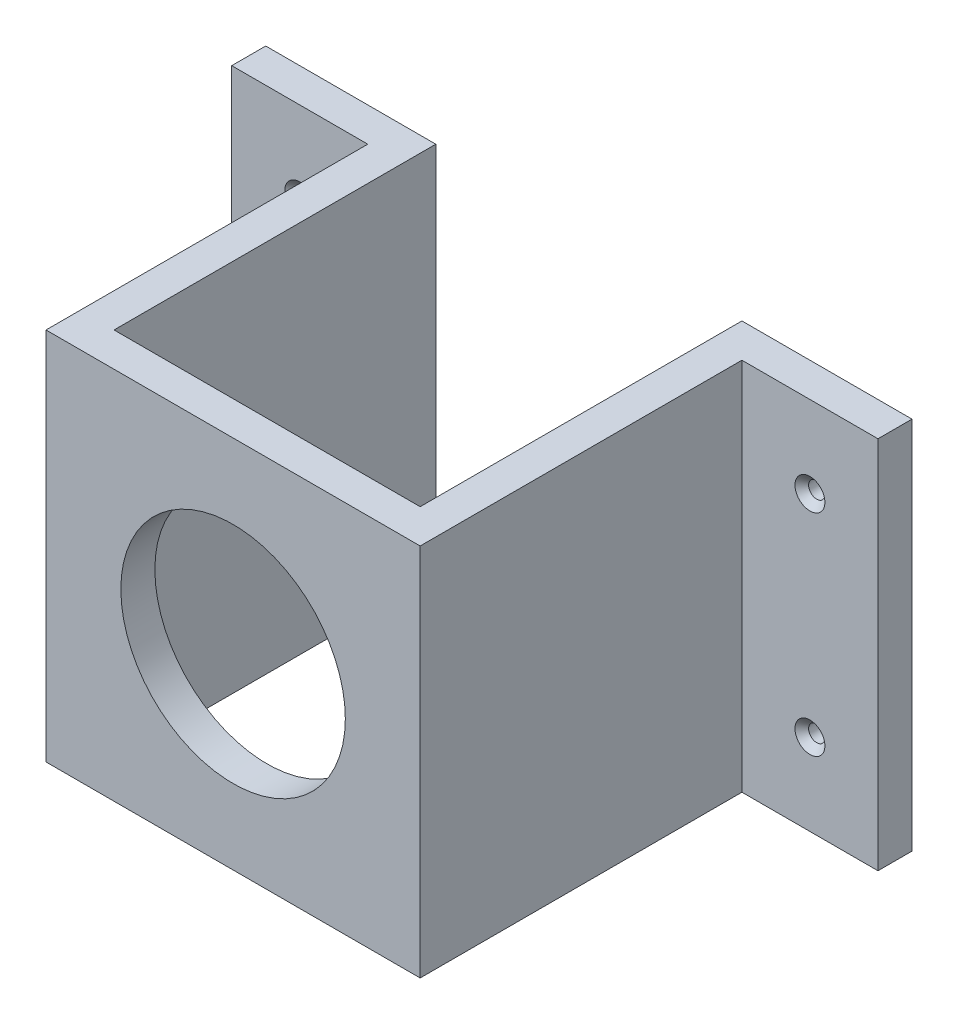
ISO-10303-21;
HEADER;
FILE_DESCRIPTION(('STEP AP214'),'2;1');
FILE_NAME('part.step','',(''),(''),'','','');
FILE_SCHEMA(('AUTOMOTIVE_DESIGN { 1 0 10303 214 1 1 1 1 }'));
ENDSEC;
DATA;
#1=APPLICATION_CONTEXT('core data for automotive mechanical design processes');
#2=APPLICATION_PROTOCOL_DEFINITION('international standard','automotive_design',2000,#1);
#3=PRODUCT_CONTEXT('',#1,'mechanical');
#4=PRODUCT('Part','Part','',(#3));
#5=PRODUCT_RELATED_PRODUCT_CATEGORY('part','',(#4));
#6=PRODUCT_DEFINITION_FORMATION('','',#4);
#7=PRODUCT_DEFINITION_CONTEXT('part definition',#1,'design');
#8=PRODUCT_DEFINITION('design','',#6,#7);
#9=PRODUCT_DEFINITION_SHAPE('','',#8);
#10=(LENGTH_UNIT() NAMED_UNIT(*) SI_UNIT(.MILLI.,.METRE.));
#11=(NAMED_UNIT(*) PLANE_ANGLE_UNIT() SI_UNIT($,.RADIAN.));
#12=(NAMED_UNIT(*) SI_UNIT($,.STERADIAN.) SOLID_ANGLE_UNIT());
#13=UNCERTAINTY_MEASURE_WITH_UNIT(LENGTH_MEASURE(1.E-05),#10,'distance_accuracy_value','');
#14=(GEOMETRIC_REPRESENTATION_CONTEXT(3) GLOBAL_UNCERTAINTY_ASSIGNED_CONTEXT((#13)) GLOBAL_UNIT_ASSIGNED_CONTEXT((#10,
#11,#12)) REPRESENTATION_CONTEXT('',''));
#15=CARTESIAN_POINT('',(0.,0.,0.));
#16=DIRECTION('',(0.,0.,1.));
#17=DIRECTION('',(1.,0.,0.));
#18=AXIS2_PLACEMENT_3D('',#15,#16,#17);
#19=CARTESIAN_POINT('',(-27.5,27.5,5.));
#20=DIRECTION('',(1.,0.,0.));
#21=DIRECTION('',(0.,1.,0.));
#22=AXIS2_PLACEMENT_3D('',#19,#20,#21);
#23=PLANE('',#22);
#24=DIRECTION('',(0.,1.,0.));
#25=VECTOR('',#24,1.);
#26=CARTESIAN_POINT('',(-27.5,27.5,-42.3));
#27=LINE('',#26,#25);
#28=CARTESIAN_POINT('',(-27.5,-27.5,-42.3));
#29=VERTEX_POINT('',#28);
#30=CARTESIAN_POINT('',(-27.5,27.5,-42.3));
#31=VERTEX_POINT('',#30);
#32=EDGE_CURVE('E50',#29,#31,#27,.T.);
#33=ORIENTED_EDGE('',*,*,#32,.F.);
#34=DIRECTION('',(0.,0.,-1.));
#35=VECTOR('',#34,1.);
#36=CARTESIAN_POINT('',(-27.5,-27.5,5.));
#37=LINE('',#36,#35);
#38=CARTESIAN_POINT('',(-27.5,-27.5,5.));
#39=VERTEX_POINT('',#38);
#40=EDGE_CURVE('E165',#39,#29,#37,.T.);
#41=ORIENTED_EDGE('',*,*,#40,.F.);
#42=DIRECTION('',(0.,-1.,0.));
#43=VECTOR('',#42,1.);
#44=CARTESIAN_POINT('',(-27.5,27.5,5.));
#45=LINE('',#44,#43);
#46=CARTESIAN_POINT('',(-27.5,27.5,5.));
#47=VERTEX_POINT('',#46);
#48=EDGE_CURVE('E323',#47,#39,#45,.T.);
#49=ORIENTED_EDGE('',*,*,#48,.F.);
#50=DIRECTION('',(0.,0.,-1.));
#51=VECTOR('',#50,1.);
#52=CARTESIAN_POINT('',(-27.5,27.5,5.));
#53=LINE('',#52,#51);
#54=EDGE_CURVE('E42',#47,#31,#53,.T.);
#55=ORIENTED_EDGE('',*,*,#54,.T.);
#56=EDGE_LOOP('',(#33,#41,#49,#55));
#57=FACE_BOUND('',#56,.T.);
#58=ADVANCED_FACE('F33',(#57),#23,.F.);
#59=CARTESIAN_POINT('',(27.5,27.5,5.));
#60=DIRECTION('',(-1.,0.,0.));
#61=DIRECTION('',(0.,-1.,0.));
#62=AXIS2_PLACEMENT_3D('',#59,#60,#61);
#63=PLANE('',#62);
#64=DIRECTION('',(0.,-1.,0.));
#65=VECTOR('',#64,1.);
#66=CARTESIAN_POINT('',(27.5,27.5,-42.3));
#67=LINE('',#66,#65);
#68=CARTESIAN_POINT('',(27.5,27.5,-42.3));
#69=VERTEX_POINT('',#68);
#70=CARTESIAN_POINT('',(27.5,-27.5,-42.3));
#71=VERTEX_POINT('',#70);
#72=EDGE_CURVE('E58',#69,#71,#67,.T.);
#73=ORIENTED_EDGE('',*,*,#72,.F.);
#74=DIRECTION('',(0.,0.,-1.));
#75=VECTOR('',#74,1.);
#76=CARTESIAN_POINT('',(27.5,27.5,5.));
#77=LINE('',#76,#75);
#78=CARTESIAN_POINT('',(27.5,27.5,5.));
#79=VERTEX_POINT('',#78);
#80=EDGE_CURVE('E11',#79,#69,#77,.T.);
#81=ORIENTED_EDGE('',*,*,#80,.F.);
#82=DIRECTION('',(0.,1.,0.));
#83=VECTOR('',#82,1.);
#84=CARTESIAN_POINT('',(27.5,27.5,5.));
#85=LINE('',#84,#83);
#86=CARTESIAN_POINT('',(27.5,-27.5,5.));
#87=VERTEX_POINT('',#86);
#88=EDGE_CURVE('E303',#87,#79,#85,.T.);
#89=ORIENTED_EDGE('',*,*,#88,.F.);
#90=DIRECTION('',(0.,0.,-1.));
#91=VECTOR('',#90,1.);
#92=CARTESIAN_POINT('',(27.5,-27.5,5.));
#93=LINE('',#92,#91);
#94=EDGE_CURVE('E275',#87,#71,#93,.T.);
#95=ORIENTED_EDGE('',*,*,#94,.T.);
#96=EDGE_LOOP('',(#73,#81,#89,#95));
#97=FACE_BOUND('',#96,.T.);
#98=ADVANCED_FACE('F35',(#97),#63,.F.);
#99=CARTESIAN_POINT('',(0.,0.,0.));
#100=DIRECTION('',(0.,0.,1.));
#101=DIRECTION('',(1.,0.,0.));
#102=AXIS2_PLACEMENT_3D('',#99,#100,#101);
#103=PLANE('',#102);
#104=CARTESIAN_POINT('',(0.,0.,0.));
#105=DIRECTION('',(0.,0.,1.));
#106=DIRECTION('',(1.,0.,0.));
#107=AXIS2_PLACEMENT_3D('',#104,#105,#106);
#108=CIRCLE('',#107,16.5);
#109=CARTESIAN_POINT('',(16.5,0.,0.));
#110=VERTEX_POINT('',#109);
#111=EDGE_CURVE('E255',#110,#110,#108,.F.);
#112=ORIENTED_EDGE('',*,*,#111,.F.);
#113=EDGE_LOOP('',(#112));
#114=FACE_BOUND('',#113,.T.);
#115=DIRECTION('',(0.,-1.,0.));
#116=VECTOR('',#115,1.);
#117=CARTESIAN_POINT('',(-22.5,27.5,0.));
#118=LINE('',#117,#116);
#119=CARTESIAN_POINT('',(-22.5,27.5,0.));
#120=VERTEX_POINT('',#119);
#121=CARTESIAN_POINT('',(-22.5,-27.5,0.));
#122=VERTEX_POINT('',#121);
#123=EDGE_CURVE('E284',#120,#122,#118,.T.);
#124=ORIENTED_EDGE('',*,*,#123,.F.);
#125=DIRECTION('',(-1.,0.,0.));
#126=VECTOR('',#125,1.);
#127=CARTESIAN_POINT('',(-27.5,27.5,0.));
#128=LINE('',#127,#126);
#129=CARTESIAN_POINT('',(22.5,27.5,0.));
#130=VERTEX_POINT('',#129);
#131=EDGE_CURVE('E270',#130,#120,#128,.T.);
#132=ORIENTED_EDGE('',*,*,#131,.F.);
#133=DIRECTION('',(0.,1.,0.));
#134=VECTOR('',#133,1.);
#135=CARTESIAN_POINT('',(22.5,27.5,0.));
#136=LINE('',#135,#134);
#137=CARTESIAN_POINT('',(22.5,-27.5,0.));
#138=VERTEX_POINT('',#137);
#139=EDGE_CURVE('E293',#138,#130,#136,.T.);
#140=ORIENTED_EDGE('',*,*,#139,.F.);
#141=DIRECTION('',(1.,0.,0.));
#142=VECTOR('',#141,1.);
#143=CARTESIAN_POINT('',(-27.5,-27.5,0.));
#144=LINE('',#143,#142);
#145=EDGE_CURVE('E315',#122,#138,#144,.T.);
#146=ORIENTED_EDGE('',*,*,#145,.F.);
#147=EDGE_LOOP('',(#124,#132,#140,#146));
#148=FACE_BOUND('',#147,.T.);
#149=ADVANCED_FACE('F225',(#114,#148),#103,.F.);
#150=CARTESIAN_POINT('',(-27.5,27.5,5.));
#151=DIRECTION('',(0.,-1.,0.));
#152=DIRECTION('',(0.,0.,-1.));
#153=AXIS2_PLACEMENT_3D('',#150,#151,#152);
#154=PLANE('',#153);
#155=ORIENTED_EDGE('',*,*,#80,.T.);
#156=DIRECTION('',(-1.,0.,0.));
#157=VECTOR('',#156,1.);
#158=CARTESIAN_POINT('',(47.5,27.5,-42.3));
#159=LINE('',#158,#157);
#160=CARTESIAN_POINT('',(47.5,27.5,-42.3));
#161=VERTEX_POINT('',#160);
#162=EDGE_CURVE('E240',#161,#69,#159,.T.);
#163=ORIENTED_EDGE('',*,*,#162,.F.);
#164=DIRECTION('',(0.,0.,1.));
#165=VECTOR('',#164,1.);
#166=CARTESIAN_POINT('',(47.5,27.5,-47.3));
#167=LINE('',#166,#165);
#168=CARTESIAN_POINT('',(47.5,27.5,-47.3));
#169=VERTEX_POINT('',#168);
#170=EDGE_CURVE('E353',#169,#161,#167,.T.);
#171=ORIENTED_EDGE('',*,*,#170,.F.);
#172=DIRECTION('',(1.,0.,0.));
#173=VECTOR('',#172,1.);
#174=CARTESIAN_POINT('',(27.5,27.5,-47.3));
#175=LINE('',#174,#173);
#176=CARTESIAN_POINT('',(22.5,27.5,-47.3));
#177=VERTEX_POINT('',#176);
#178=EDGE_CURVE('E298',#177,#169,#175,.T.);
#179=ORIENTED_EDGE('',*,*,#178,.F.);
#180=DIRECTION('',(0.,0.,1.));
#181=VECTOR('',#180,1.);
#182=CARTESIAN_POINT('',(22.5,27.5,-47.3));
#183=LINE('',#182,#181);
#184=EDGE_CURVE('E300',#177,#130,#183,.T.);
#185=ORIENTED_EDGE('',*,*,#184,.T.);
#186=ORIENTED_EDGE('',*,*,#131,.T.);
#187=DIRECTION('',(0.,0.,1.));
#188=VECTOR('',#187,1.);
#189=CARTESIAN_POINT('',(-22.5,27.5,-47.3));
#190=LINE('',#189,#188);
#191=CARTESIAN_POINT('',(-22.5,27.5,-47.3));
#192=VERTEX_POINT('',#191);
#193=EDGE_CURVE('E291',#192,#120,#190,.T.);
#194=ORIENTED_EDGE('',*,*,#193,.F.);
#195=DIRECTION('',(1.,0.,0.));
#196=VECTOR('',#195,1.);
#197=CARTESIAN_POINT('',(-27.5,27.5,-47.3));
#198=LINE('',#197,#196);
#199=CARTESIAN_POINT('',(-47.5,27.5,-47.3));
#200=VERTEX_POINT('',#199);
#201=EDGE_CURVE('E285',#200,#192,#198,.T.);
#202=ORIENTED_EDGE('',*,*,#201,.F.);
#203=DIRECTION('',(0.,0.,-1.));
#204=VECTOR('',#203,1.);
#205=CARTESIAN_POINT('',(-47.5,27.5,-47.3));
#206=LINE('',#205,#204);
#207=CARTESIAN_POINT('',(-47.5,27.5,-42.3));
#208=VERTEX_POINT('',#207);
#209=EDGE_CURVE('E148',#208,#200,#206,.T.);
#210=ORIENTED_EDGE('',*,*,#209,.F.);
#211=DIRECTION('',(1.,0.,0.));
#212=VECTOR('',#211,1.);
#213=CARTESIAN_POINT('',(-47.5,27.5,-42.3));
#214=LINE('',#213,#212);
#215=EDGE_CURVE('E158',#208,#31,#214,.T.);
#216=ORIENTED_EDGE('',*,*,#215,.T.);
#217=ORIENTED_EDGE('',*,*,#54,.F.);
#218=DIRECTION('',(-1.,0.,0.));
#219=VECTOR('',#218,1.);
#220=CARTESIAN_POINT('',(-27.5,27.5,5.));
#221=LINE('',#220,#219);
#222=EDGE_CURVE('E243',#79,#47,#221,.T.);
#223=ORIENTED_EDGE('',*,*,#222,.F.);
#224=EDGE_LOOP('',(#155,#163,#171,#179,#185,#186,#194,#202,#210,#216,#217,#223));
#225=FACE_BOUND('',#224,.T.);
#226=ADVANCED_FACE('F228',(#225),#154,.F.);
#227=CARTESIAN_POINT('',(-27.5,-27.5,5.));
#228=DIRECTION('',(0.,1.,0.));
#229=DIRECTION('',(0.,0.,1.));
#230=AXIS2_PLACEMENT_3D('',#227,#228,#229);
#231=PLANE('',#230);
#232=ORIENTED_EDGE('',*,*,#40,.T.);
#233=DIRECTION('',(1.,0.,0.));
#234=VECTOR('',#233,1.);
#235=CARTESIAN_POINT('',(-47.5,-27.5,-42.3));
#236=LINE('',#235,#234);
#237=CARTESIAN_POINT('',(-47.5,-27.5,-42.3));
#238=VERTEX_POINT('',#237);
#239=EDGE_CURVE('E140',#238,#29,#236,.T.);
#240=ORIENTED_EDGE('',*,*,#239,.F.);
#241=DIRECTION('',(0.,0.,1.));
#242=VECTOR('',#241,1.);
#243=CARTESIAN_POINT('',(-47.5,-27.5,-47.3));
#244=LINE('',#243,#242);
#245=CARTESIAN_POINT('',(-47.5,-27.5,-47.3));
#246=VERTEX_POINT('',#245);
#247=EDGE_CURVE('E137',#246,#238,#244,.T.);
#248=ORIENTED_EDGE('',*,*,#247,.F.);
#249=DIRECTION('',(-1.,0.,0.));
#250=VECTOR('',#249,1.);
#251=CARTESIAN_POINT('',(-27.5,-27.5,-47.3));
#252=LINE('',#251,#250);
#253=CARTESIAN_POINT('',(-22.5,-27.5,-47.3));
#254=VERTEX_POINT('',#253);
#255=EDGE_CURVE('E125',#254,#246,#252,.T.);
#256=ORIENTED_EDGE('',*,*,#255,.F.);
#257=DIRECTION('',(0.,0.,1.));
#258=VECTOR('',#257,1.);
#259=CARTESIAN_POINT('',(-22.5,-27.5,-47.3));
#260=LINE('',#259,#258);
#261=EDGE_CURVE('E134',#254,#122,#260,.T.);
#262=ORIENTED_EDGE('',*,*,#261,.T.);
#263=ORIENTED_EDGE('',*,*,#145,.T.);
#264=DIRECTION('',(0.,0.,1.));
#265=VECTOR('',#264,1.);
#266=CARTESIAN_POINT('',(22.5,-27.5,-47.3));
#267=LINE('',#266,#265);
#268=CARTESIAN_POINT('',(22.5,-27.5,-47.3));
#269=VERTEX_POINT('',#268);
#270=EDGE_CURVE('E309',#269,#138,#267,.T.);
#271=ORIENTED_EDGE('',*,*,#270,.F.);
#272=DIRECTION('',(-1.,0.,0.));
#273=VECTOR('',#272,1.);
#274=CARTESIAN_POINT('',(27.5,-27.5,-47.3));
#275=LINE('',#274,#273);
#276=CARTESIAN_POINT('',(47.5,-27.5,-47.3));
#277=VERTEX_POINT('',#276);
#278=EDGE_CURVE('E294',#277,#269,#275,.T.);
#279=ORIENTED_EDGE('',*,*,#278,.F.);
#280=DIRECTION('',(0.,0.,-1.));
#281=VECTOR('',#280,1.);
#282=CARTESIAN_POINT('',(47.5,-27.5,-47.3));
#283=LINE('',#282,#281);
#284=CARTESIAN_POINT('',(47.5,-27.5,-42.3));
#285=VERTEX_POINT('',#284);
#286=EDGE_CURVE('E257',#285,#277,#283,.T.);
#287=ORIENTED_EDGE('',*,*,#286,.F.);
#288=DIRECTION('',(-1.,0.,0.));
#289=VECTOR('',#288,1.);
#290=CARTESIAN_POINT('',(47.5,-27.5,-42.3));
#291=LINE('',#290,#289);
#292=EDGE_CURVE('E252',#285,#71,#291,.T.);
#293=ORIENTED_EDGE('',*,*,#292,.T.);
#294=ORIENTED_EDGE('',*,*,#94,.F.);
#295=DIRECTION('',(1.,0.,0.));
#296=VECTOR('',#295,1.);
#297=CARTESIAN_POINT('',(-27.5,-27.5,5.));
#298=LINE('',#297,#296);
#299=EDGE_CURVE('E321',#39,#87,#298,.T.);
#300=ORIENTED_EDGE('',*,*,#299,.F.);
#301=EDGE_LOOP('',(#232,#240,#248,#256,#262,#263,#271,#279,#287,#293,#294,#300));
#302=FACE_BOUND('',#301,.T.);
#303=ADVANCED_FACE('F138',(#302),#231,.F.);
#304=CARTESIAN_POINT('',(0.,0.,5.));
#305=DIRECTION('',(0.,0.,1.));
#306=DIRECTION('',(1.,0.,0.));
#307=AXIS2_PLACEMENT_3D('',#304,#305,#306);
#308=PLANE('',#307);
#309=CARTESIAN_POINT('',(0.,0.,5.));
#310=DIRECTION('',(0.,0.,1.));
#311=DIRECTION('',(1.,0.,0.));
#312=AXIS2_PLACEMENT_3D('',#309,#310,#311);
#313=CIRCLE('',#312,16.5);
#314=CARTESIAN_POINT('',(16.5,0.,5.));
#315=VERTEX_POINT('',#314);
#316=EDGE_CURVE('E251',#315,#315,#313,.T.);
#317=ORIENTED_EDGE('',*,*,#316,.F.);
#318=EDGE_LOOP('',(#317));
#319=FACE_BOUND('',#318,.T.);
#320=ORIENTED_EDGE('',*,*,#88,.T.);
#321=ORIENTED_EDGE('',*,*,#222,.T.);
#322=ORIENTED_EDGE('',*,*,#48,.T.);
#323=ORIENTED_EDGE('',*,*,#299,.T.);
#324=EDGE_LOOP('',(#320,#321,#322,#323));
#325=FACE_BOUND('',#324,.T.);
#326=ADVANCED_FACE('F235',(#319,#325),#308,.T.);
#327=CARTESIAN_POINT('',(22.5,27.5,-47.3));
#328=DIRECTION('',(1.,0.,0.));
#329=DIRECTION('',(0.,1.,0.));
#330=AXIS2_PLACEMENT_3D('',#327,#328,#329);
#331=PLANE('',#330);
#332=ORIENTED_EDGE('',*,*,#139,.T.);
#333=ORIENTED_EDGE('',*,*,#184,.F.);
#334=DIRECTION('',(0.,1.,0.));
#335=VECTOR('',#334,1.);
#336=CARTESIAN_POINT('',(22.5,27.5,-47.3));
#337=LINE('',#336,#335);
#338=EDGE_CURVE('E296',#269,#177,#337,.T.);
#339=ORIENTED_EDGE('',*,*,#338,.F.);
#340=ORIENTED_EDGE('',*,*,#270,.T.);
#341=EDGE_LOOP('',(#332,#333,#339,#340));
#342=FACE_BOUND('',#341,.T.);
#343=ADVANCED_FACE('F343',(#342),#331,.F.);
#344=CARTESIAN_POINT('',(0.,0.,-47.3));
#345=DIRECTION('',(0.,0.,-1.));
#346=DIRECTION('',(-1.,0.,0.));
#347=AXIS2_PLACEMENT_3D('',#344,#345,#346);
#348=PLANE('',#347);
#349=CARTESIAN_POINT('',(37.5,15.5,-47.3));
#350=DIRECTION('',(0.,0.,-1.));
#351=DIRECTION('',(-1.,0.,0.));
#352=AXIS2_PLACEMENT_3D('',#349,#350,#351);
#353=CIRCLE('',#352,1.2);
#354=CARTESIAN_POINT('',(36.3,15.5,-47.3));
#355=VERTEX_POINT('',#354);
#356=EDGE_CURVE('E177',#355,#355,#353,.T.);
#357=ORIENTED_EDGE('',*,*,#356,.F.);
#358=EDGE_LOOP('',(#357));
#359=FACE_BOUND('',#358,.T.);
#360=CARTESIAN_POINT('',(37.5,-15.5,-47.3));
#361=DIRECTION('',(0.,0.,-1.));
#362=DIRECTION('',(-1.,0.,0.));
#363=AXIS2_PLACEMENT_3D('',#360,#361,#362);
#364=CIRCLE('',#363,1.2);
#365=CARTESIAN_POINT('',(36.3,-15.5,-47.3));
#366=VERTEX_POINT('',#365);
#367=EDGE_CURVE('E150',#366,#366,#364,.T.);
#368=ORIENTED_EDGE('',*,*,#367,.F.);
#369=EDGE_LOOP('',(#368));
#370=FACE_BOUND('',#369,.T.);
#371=ORIENTED_EDGE('',*,*,#178,.T.);
#372=DIRECTION('',(0.,1.,0.));
#373=VECTOR('',#372,1.);
#374=CARTESIAN_POINT('',(47.5,27.5,-47.3));
#375=LINE('',#374,#373);
#376=EDGE_CURVE('E161',#277,#169,#375,.T.);
#377=ORIENTED_EDGE('',*,*,#376,.F.);
#378=ORIENTED_EDGE('',*,*,#278,.T.);
#379=ORIENTED_EDGE('',*,*,#338,.T.);
#380=EDGE_LOOP('',(#371,#377,#378,#379));
#381=FACE_BOUND('',#380,.T.);
#382=ADVANCED_FACE('F346',(#359,#370,#381),#348,.T.);
#383=CARTESIAN_POINT('',(-22.5,27.5,-47.3));
#384=DIRECTION('',(-1.,0.,0.));
#385=DIRECTION('',(0.,-1.,0.));
#386=AXIS2_PLACEMENT_3D('',#383,#384,#385);
#387=PLANE('',#386);
#388=ORIENTED_EDGE('',*,*,#123,.T.);
#389=ORIENTED_EDGE('',*,*,#261,.F.);
#390=DIRECTION('',(0.,-1.,0.));
#391=VECTOR('',#390,1.);
#392=CARTESIAN_POINT('',(-22.5,27.5,-47.3));
#393=LINE('',#392,#391);
#394=EDGE_CURVE('E131',#192,#254,#393,.T.);
#395=ORIENTED_EDGE('',*,*,#394,.F.);
#396=ORIENTED_EDGE('',*,*,#193,.T.);
#397=EDGE_LOOP('',(#388,#389,#395,#396));
#398=FACE_BOUND('',#397,.T.);
#399=ADVANCED_FACE('F335',(#398),#387,.F.);
#400=CARTESIAN_POINT('',(0.,0.,-47.3));
#401=DIRECTION('',(0.,0.,1.));
#402=DIRECTION('',(1.,0.,0.));
#403=AXIS2_PLACEMENT_3D('',#400,#401,#402);
#404=PLANE('',#403);
#405=CARTESIAN_POINT('',(-37.5,15.5,-47.3));
#406=DIRECTION('',(0.,0.,1.));
#407=DIRECTION('',(1.,0.,0.));
#408=AXIS2_PLACEMENT_3D('',#405,#406,#407);
#409=CIRCLE('',#408,1.2);
#410=CARTESIAN_POINT('',(-36.3,15.5,-47.3));
#411=VERTEX_POINT('',#410);
#412=EDGE_CURVE('E37',#411,#411,#409,.T.);
#413=ORIENTED_EDGE('',*,*,#412,.T.);
#414=EDGE_LOOP('',(#413));
#415=FACE_BOUND('',#414,.T.);
#416=CARTESIAN_POINT('',(-37.5,-15.5,-47.3));
#417=DIRECTION('',(0.,0.,1.));
#418=DIRECTION('',(1.,0.,0.));
#419=AXIS2_PLACEMENT_3D('',#416,#417,#418);
#420=CIRCLE('',#419,1.2);
#421=CARTESIAN_POINT('',(-36.3,-15.5,-47.3));
#422=VERTEX_POINT('',#421);
#423=EDGE_CURVE('E181',#422,#422,#420,.T.);
#424=ORIENTED_EDGE('',*,*,#423,.T.);
#425=EDGE_LOOP('',(#424));
#426=FACE_BOUND('',#425,.T.);
#427=ORIENTED_EDGE('',*,*,#255,.T.);
#428=DIRECTION('',(0.,-1.,0.));
#429=VECTOR('',#428,1.);
#430=CARTESIAN_POINT('',(-47.5,27.5,-47.3));
#431=LINE('',#430,#429);
#432=EDGE_CURVE('E129',#200,#246,#431,.T.);
#433=ORIENTED_EDGE('',*,*,#432,.F.);
#434=ORIENTED_EDGE('',*,*,#201,.T.);
#435=ORIENTED_EDGE('',*,*,#394,.T.);
#436=EDGE_LOOP('',(#427,#433,#434,#435));
#437=FACE_BOUND('',#436,.T.);
#438=ADVANCED_FACE('F127',(#415,#426,#437),#404,.F.);
#439=CARTESIAN_POINT('',(0.,0.,-47.301025));
#440=DIRECTION('',(0.,0.,1.));
#441=DIRECTION('',(1.,0.,0.));
#442=AXIS2_PLACEMENT_3D('',#439,#440,#441);
#443=CYLINDRICAL_SURFACE('',#442,16.5);
#444=ORIENTED_EDGE('',*,*,#316,.T.);
#445=EDGE_LOOP('',(#444));
#446=FACE_BOUND('',#445,.T.);
#447=ORIENTED_EDGE('',*,*,#111,.T.);
#448=EDGE_LOOP('',(#447));
#449=FACE_BOUND('',#448,.T.);
#450=ADVANCED_FACE('F364',(#446,#449),#443,.F.);
#451=CARTESIAN_POINT('',(47.5,27.5,-42.3));
#452=DIRECTION('',(0.,0.,-1.));
#453=DIRECTION('',(0.,1.,0.));
#454=AXIS2_PLACEMENT_3D('',#451,#452,#453);
#455=PLANE('',#454);
#456=CARTESIAN_POINT('',(37.5,15.5,-42.3));
#457=DIRECTION('',(0.,0.,1.));
#458=DIRECTION('',(1.,0.,0.));
#459=AXIS2_PLACEMENT_3D('',#456,#457,#458);
#460=CIRCLE('',#459,2.2);
#461=CARTESIAN_POINT('',(39.7,15.5,-42.3));
#462=VERTEX_POINT('',#461);
#463=EDGE_CURVE('E183',#462,#462,#460,.T.);
#464=ORIENTED_EDGE('',*,*,#463,.F.);
#465=EDGE_LOOP('',(#464));
#466=FACE_BOUND('',#465,.T.);
#467=CARTESIAN_POINT('',(37.5,-15.5,-42.3));
#468=DIRECTION('',(0.,0.,1.));
#469=DIRECTION('',(1.,0.,0.));
#470=AXIS2_PLACEMENT_3D('',#467,#468,#469);
#471=CIRCLE('',#470,2.2);
#472=CARTESIAN_POINT('',(39.7,-15.5,-42.3));
#473=VERTEX_POINT('',#472);
#474=EDGE_CURVE('E179',#473,#473,#471,.T.);
#475=ORIENTED_EDGE('',*,*,#474,.F.);
#476=EDGE_LOOP('',(#475));
#477=FACE_BOUND('',#476,.T.);
#478=ORIENTED_EDGE('',*,*,#72,.T.);
#479=ORIENTED_EDGE('',*,*,#292,.F.);
#480=DIRECTION('',(0.,-1.,0.));
#481=VECTOR('',#480,1.);
#482=CARTESIAN_POINT('',(47.5,27.5,-42.3));
#483=LINE('',#482,#481);
#484=EDGE_CURVE('E250',#161,#285,#483,.T.);
#485=ORIENTED_EDGE('',*,*,#484,.F.);
#486=ORIENTED_EDGE('',*,*,#162,.T.);
#487=EDGE_LOOP('',(#478,#479,#485,#486));
#488=FACE_BOUND('',#487,.T.);
#489=ADVANCED_FACE('F247',(#466,#477,#488),#455,.F.);
#490=CARTESIAN_POINT('',(47.5,0.,0.));
#491=DIRECTION('',(-1.,0.,0.));
#492=DIRECTION('',(0.,-1.,0.));
#493=AXIS2_PLACEMENT_3D('',#490,#491,#492);
#494=PLANE('',#493);
#495=ORIENTED_EDGE('',*,*,#376,.T.);
#496=ORIENTED_EDGE('',*,*,#170,.T.);
#497=ORIENTED_EDGE('',*,*,#484,.T.);
#498=ORIENTED_EDGE('',*,*,#286,.T.);
#499=EDGE_LOOP('',(#495,#496,#497,#498));
#500=FACE_BOUND('',#499,.T.);
#501=ADVANCED_FACE('F352',(#500),#494,.F.);
#502=CARTESIAN_POINT('',(-47.5,27.5,-42.3));
#503=DIRECTION('',(0.,0.,-1.));
#504=DIRECTION('',(0.,1.,0.));
#505=AXIS2_PLACEMENT_3D('',#502,#503,#504);
#506=PLANE('',#505);
#507=CARTESIAN_POINT('',(-37.5,15.5,-42.3));
#508=DIRECTION('',(0.,0.,1.));
#509=DIRECTION('',(1.,0.,0.));
#510=AXIS2_PLACEMENT_3D('',#507,#508,#509);
#511=CIRCLE('',#510,2.2);
#512=CARTESIAN_POINT('',(-35.3,15.5,-42.3));
#513=VERTEX_POINT('',#512);
#514=EDGE_CURVE('E505',#513,#513,#511,.T.);
#515=ORIENTED_EDGE('',*,*,#514,.F.);
#516=EDGE_LOOP('',(#515));
#517=FACE_BOUND('',#516,.T.);
#518=CARTESIAN_POINT('',(-37.5,-15.5,-42.3));
#519=DIRECTION('',(0.,0.,1.));
#520=DIRECTION('',(1.,0.,0.));
#521=AXIS2_PLACEMENT_3D('',#518,#519,#520);
#522=CIRCLE('',#521,2.2);
#523=CARTESIAN_POINT('',(-35.3,-15.5,-42.3));
#524=VERTEX_POINT('',#523);
#525=EDGE_CURVE('E190',#524,#524,#522,.T.);
#526=ORIENTED_EDGE('',*,*,#525,.F.);
#527=EDGE_LOOP('',(#526));
#528=FACE_BOUND('',#527,.T.);
#529=ORIENTED_EDGE('',*,*,#32,.T.);
#530=ORIENTED_EDGE('',*,*,#215,.F.);
#531=DIRECTION('',(0.,1.,0.));
#532=VECTOR('',#531,1.);
#533=CARTESIAN_POINT('',(-47.5,27.5,-42.3));
#534=LINE('',#533,#532);
#535=EDGE_CURVE('E143',#238,#208,#534,.T.);
#536=ORIENTED_EDGE('',*,*,#535,.F.);
#537=ORIENTED_EDGE('',*,*,#239,.T.);
#538=EDGE_LOOP('',(#529,#530,#536,#537));
#539=FACE_BOUND('',#538,.T.);
#540=ADVANCED_FACE('F329',(#517,#528,#539),#506,.F.);
#541=CARTESIAN_POINT('',(-47.5,0.,0.));
#542=DIRECTION('',(-1.,0.,0.));
#543=DIRECTION('',(0.,-1.,0.));
#544=AXIS2_PLACEMENT_3D('',#541,#542,#543);
#545=PLANE('',#544);
#546=ORIENTED_EDGE('',*,*,#432,.T.);
#547=ORIENTED_EDGE('',*,*,#247,.T.);
#548=ORIENTED_EDGE('',*,*,#535,.T.);
#549=ORIENTED_EDGE('',*,*,#209,.T.);
#550=EDGE_LOOP('',(#546,#547,#548,#549));
#551=FACE_BOUND('',#550,.T.);
#552=ADVANCED_FACE('F146',(#551),#545,.T.);
#553=CARTESIAN_POINT('',(37.5,-15.5,-42.3));
#554=DIRECTION('',(0.,0.,1.));
#555=DIRECTION('',(1.,0.,0.));
#556=AXIS2_PLACEMENT_3D('',#553,#554,#555);
#557=CYLINDRICAL_SURFACE('',#556,1.2);
#558=ORIENTED_EDGE('',*,*,#367,.T.);
#559=EDGE_LOOP('',(#558));
#560=FACE_BOUND('',#559,.T.);
#561=CARTESIAN_POINT('',(37.5,-15.5,-43.3));
#562=DIRECTION('',(0.,0.,1.));
#563=DIRECTION('',(1.,0.,0.));
#564=AXIS2_PLACEMENT_3D('',#561,#562,#563);
#565=CIRCLE('',#564,1.2);
#566=CARTESIAN_POINT('',(38.7,-15.5,-43.3));
#567=VERTEX_POINT('',#566);
#568=EDGE_CURVE('E153',#567,#567,#565,.T.);
#569=ORIENTED_EDGE('',*,*,#568,.T.);
#570=EDGE_LOOP('',(#569));
#571=FACE_BOUND('',#570,.T.);
#572=ADVANCED_FACE('F205',(#560,#571),#557,.F.);
#573=CARTESIAN_POINT('',(37.5,-15.5,-42.3));
#574=DIRECTION('',(0.,0.,1.));
#575=DIRECTION('',(1.,0.,0.));
#576=AXIS2_PLACEMENT_3D('',#573,#574,#575);
#577=CONICAL_SURFACE('',#576,2.2,0.785398163397448);
#578=ORIENTED_EDGE('',*,*,#568,.F.);
#579=EDGE_LOOP('',(#578));
#580=FACE_BOUND('',#579,.T.);
#581=ORIENTED_EDGE('',*,*,#474,.T.);
#582=EDGE_LOOP('',(#581));
#583=FACE_BOUND('',#582,.T.);
#584=ADVANCED_FACE('F207',(#580,#583),#577,.F.);
#585=CARTESIAN_POINT('',(37.5,15.5,-42.3));
#586=DIRECTION('',(0.,0.,1.));
#587=DIRECTION('',(1.,0.,0.));
#588=AXIS2_PLACEMENT_3D('',#585,#586,#587);
#589=CYLINDRICAL_SURFACE('',#588,1.2);
#590=ORIENTED_EDGE('',*,*,#356,.T.);
#591=EDGE_LOOP('',(#590));
#592=FACE_BOUND('',#591,.T.);
#593=CARTESIAN_POINT('',(37.5,15.5,-43.3));
#594=DIRECTION('',(0.,0.,1.));
#595=DIRECTION('',(1.,0.,0.));
#596=AXIS2_PLACEMENT_3D('',#593,#594,#595);
#597=CIRCLE('',#596,1.2);
#598=CARTESIAN_POINT('',(38.7,15.5,-43.3));
#599=VERTEX_POINT('',#598);
#600=EDGE_CURVE('E180',#599,#599,#597,.T.);
#601=ORIENTED_EDGE('',*,*,#600,.T.);
#602=EDGE_LOOP('',(#601));
#603=FACE_BOUND('',#602,.T.);
#604=ADVANCED_FACE('F209',(#592,#603),#589,.F.);
#605=CARTESIAN_POINT('',(37.5,15.5,-42.3));
#606=DIRECTION('',(0.,0.,1.));
#607=DIRECTION('',(1.,0.,0.));
#608=AXIS2_PLACEMENT_3D('',#605,#606,#607);
#609=CONICAL_SURFACE('',#608,2.2,0.785398163397448);
#610=ORIENTED_EDGE('',*,*,#600,.F.);
#611=EDGE_LOOP('',(#610));
#612=FACE_BOUND('',#611,.T.);
#613=ORIENTED_EDGE('',*,*,#463,.T.);
#614=EDGE_LOOP('',(#613));
#615=FACE_BOUND('',#614,.T.);
#616=ADVANCED_FACE('F215',(#612,#615),#609,.F.);
#617=CARTESIAN_POINT('',(-37.5,-15.5,-42.3));
#618=DIRECTION('',(0.,0.,1.));
#619=DIRECTION('',(1.,0.,0.));
#620=AXIS2_PLACEMENT_3D('',#617,#618,#619);
#621=CYLINDRICAL_SURFACE('',#620,1.2);
#622=CARTESIAN_POINT('',(-37.5,-15.5,-43.3));
#623=DIRECTION('',(0.,0.,1.));
#624=DIRECTION('',(1.,0.,0.));
#625=AXIS2_PLACEMENT_3D('',#622,#623,#624);
#626=CIRCLE('',#625,1.2);
#627=CARTESIAN_POINT('',(-36.3,-15.5,-43.3));
#628=VERTEX_POINT('',#627);
#629=EDGE_CURVE('E184',#628,#628,#626,.T.);
#630=ORIENTED_EDGE('',*,*,#629,.T.);
#631=EDGE_LOOP('',(#630));
#632=FACE_BOUND('',#631,.T.);
#633=ORIENTED_EDGE('',*,*,#423,.F.);
#634=EDGE_LOOP('',(#633));
#635=FACE_BOUND('',#634,.T.);
#636=ADVANCED_FACE('F456',(#632,#635),#621,.F.);
#637=CARTESIAN_POINT('',(-37.5,-15.5,-42.3));
#638=DIRECTION('',(0.,0.,1.));
#639=DIRECTION('',(1.,0.,0.));
#640=AXIS2_PLACEMENT_3D('',#637,#638,#639);
#641=CONICAL_SURFACE('',#640,2.2,0.785398163397448);
#642=ORIENTED_EDGE('',*,*,#629,.F.);
#643=EDGE_LOOP('',(#642));
#644=FACE_BOUND('',#643,.T.);
#645=ORIENTED_EDGE('',*,*,#525,.T.);
#646=EDGE_LOOP('',(#645));
#647=FACE_BOUND('',#646,.T.);
#648=ADVANCED_FACE('F466',(#644,#647),#641,.F.);
#649=CARTESIAN_POINT('',(-37.5,15.5,-42.3));
#650=DIRECTION('',(0.,0.,1.));
#651=DIRECTION('',(1.,0.,0.));
#652=AXIS2_PLACEMENT_3D('',#649,#650,#651);
#653=CYLINDRICAL_SURFACE('',#652,1.2);
#654=CARTESIAN_POINT('',(-37.5,15.5,-43.3));
#655=DIRECTION('',(0.,0.,1.));
#656=DIRECTION('',(1.,0.,0.));
#657=AXIS2_PLACEMENT_3D('',#654,#655,#656);
#658=CIRCLE('',#657,1.2);
#659=CARTESIAN_POINT('',(-36.3,15.5,-43.3));
#660=VERTEX_POINT('',#659);
#661=EDGE_CURVE('E502',#660,#660,#658,.T.);
#662=ORIENTED_EDGE('',*,*,#661,.T.);
#663=EDGE_LOOP('',(#662));
#664=FACE_BOUND('',#663,.T.);
#665=ORIENTED_EDGE('',*,*,#412,.F.);
#666=EDGE_LOOP('',(#665));
#667=FACE_BOUND('',#666,.T.);
#668=ADVANCED_FACE('F475',(#664,#667),#653,.F.);
#669=CARTESIAN_POINT('',(-37.5,15.5,-42.3));
#670=DIRECTION('',(0.,0.,1.));
#671=DIRECTION('',(1.,0.,0.));
#672=AXIS2_PLACEMENT_3D('',#669,#670,#671);
#673=CONICAL_SURFACE('',#672,2.2,0.785398163397448);
#674=ORIENTED_EDGE('',*,*,#661,.F.);
#675=EDGE_LOOP('',(#674));
#676=FACE_BOUND('',#675,.T.);
#677=ORIENTED_EDGE('',*,*,#514,.T.);
#678=EDGE_LOOP('',(#677));
#679=FACE_BOUND('',#678,.T.);
#680=ADVANCED_FACE('F485',(#676,#679),#673,.F.);
#681=CLOSED_SHELL('',(#58,#98,#149,#226,#303,#326,#343,#382,#399,#438,#450,#489,#501,#540,#552,
#572,#584,#604,#616,#636,#648,#668,#680));
#682=MANIFOLD_SOLID_BREP('B2',#681);
#683=ADVANCED_BREP_SHAPE_REPRESENTATION('',(#18,#682),#14);
#684=SHAPE_DEFINITION_REPRESENTATION(#9,#683);
ENDSEC;
END-ISO-10303-21;
